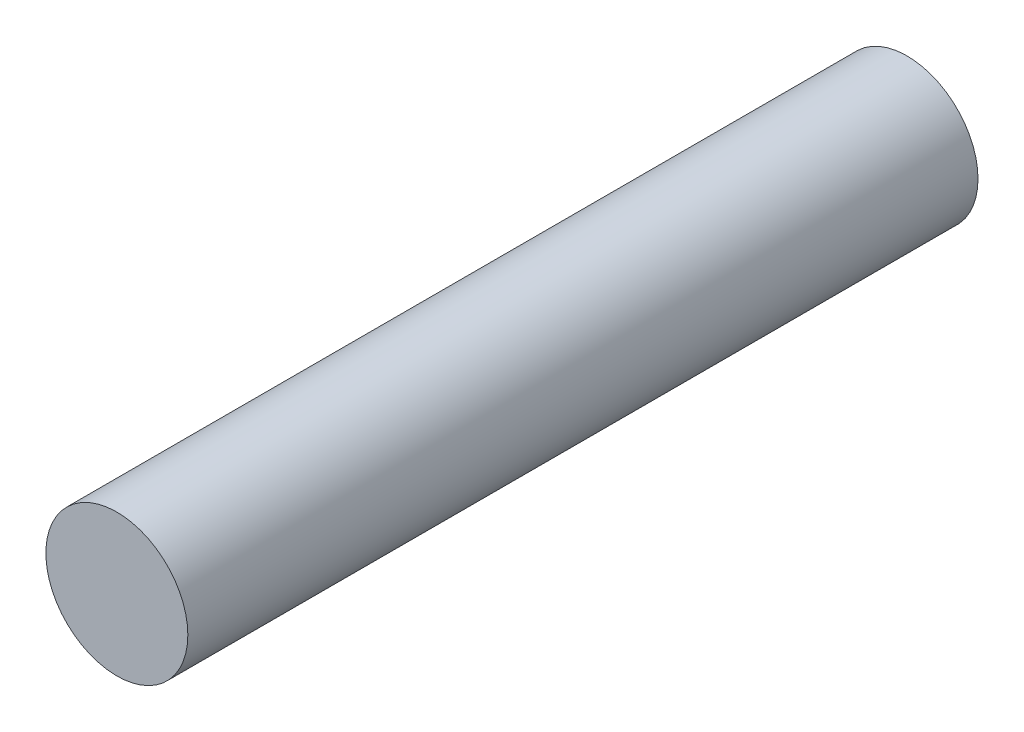
ISO-10303-21;
HEADER;
FILE_DESCRIPTION(('STEP AP214'),'2;1');
FILE_NAME('part.step','',(''),(''),'','','');
FILE_SCHEMA(('AUTOMOTIVE_DESIGN { 1 0 10303 214 1 1 1 1 }'));
ENDSEC;
DATA;
#1=APPLICATION_CONTEXT('core data for automotive mechanical design processes');
#2=APPLICATION_PROTOCOL_DEFINITION('international standard','automotive_design',2000,#1);
#3=PRODUCT_CONTEXT('',#1,'mechanical');
#4=PRODUCT('Part','Part','',(#3));
#5=PRODUCT_RELATED_PRODUCT_CATEGORY('part','',(#4));
#6=PRODUCT_DEFINITION_FORMATION('','',#4);
#7=PRODUCT_DEFINITION_CONTEXT('part definition',#1,'design');
#8=PRODUCT_DEFINITION('design','',#6,#7);
#9=PRODUCT_DEFINITION_SHAPE('','',#8);
#10=(LENGTH_UNIT() NAMED_UNIT(*) SI_UNIT(.MILLI.,.METRE.));
#11=(NAMED_UNIT(*) PLANE_ANGLE_UNIT() SI_UNIT($,.RADIAN.));
#12=(NAMED_UNIT(*) SI_UNIT($,.STERADIAN.) SOLID_ANGLE_UNIT());
#13=UNCERTAINTY_MEASURE_WITH_UNIT(LENGTH_MEASURE(1.E-05),#10,'distance_accuracy_value','');
#14=(GEOMETRIC_REPRESENTATION_CONTEXT(3) GLOBAL_UNCERTAINTY_ASSIGNED_CONTEXT((#13)) GLOBAL_UNIT_ASSIGNED_CONTEXT((#10,
#11,#12)) REPRESENTATION_CONTEXT('',''));
#15=CARTESIAN_POINT('',(0.,0.,0.));
#16=DIRECTION('',(0.,0.,1.));
#17=DIRECTION('',(1.,0.,0.));
#18=AXIS2_PLACEMENT_3D('',#15,#16,#17);
#19=CARTESIAN_POINT('',(0.,0.,101.6));
#20=DIRECTION('',(0.,0.,-1.));
#21=DIRECTION('',(-1.,0.,0.));
#22=AXIS2_PLACEMENT_3D('',#19,#20,#21);
#23=CYLINDRICAL_SURFACE('',#22,18.25625);
#24=CARTESIAN_POINT('',(0.,0.,101.6));
#25=DIRECTION('',(0.,0.,1.));
#26=DIRECTION('',(1.,0.,0.));
#27=AXIS2_PLACEMENT_3D('',#24,#25,#26);
#28=CIRCLE('',#27,18.25625);
#29=CARTESIAN_POINT('',(18.25625,0.,101.6));
#30=VERTEX_POINT('',#29);
#31=EDGE_CURVE('E10',#30,#30,#28,.T.);
#32=ORIENTED_EDGE('',*,*,#31,.F.);
#33=EDGE_LOOP('',(#32));
#34=FACE_BOUND('',#33,.T.);
#35=CARTESIAN_POINT('',(0.,0.,-101.6));
#36=DIRECTION('',(0.,0.,1.));
#37=DIRECTION('',(1.,0.,0.));
#38=AXIS2_PLACEMENT_3D('',#35,#36,#37);
#39=CIRCLE('',#38,18.25625);
#40=CARTESIAN_POINT('',(18.25625,0.,-101.6));
#41=VERTEX_POINT('',#40);
#42=EDGE_CURVE('E38',#41,#41,#39,.T.);
#43=ORIENTED_EDGE('',*,*,#42,.T.);
#44=EDGE_LOOP('',(#43));
#45=FACE_BOUND('',#44,.T.);
#46=ADVANCED_FACE('F35',(#34,#45),#23,.T.);
#47=CARTESIAN_POINT('',(0.,0.,101.6));
#48=DIRECTION('',(0.,0.,1.));
#49=DIRECTION('',(1.,0.,0.));
#50=AXIS2_PLACEMENT_3D('',#47,#48,#49);
#51=PLANE('',#50);
#52=ORIENTED_EDGE('',*,*,#31,.T.);
#53=EDGE_LOOP('',(#52));
#54=FACE_BOUND('',#53,.T.);
#55=ADVANCED_FACE('F50',(#54),#51,.T.);
#56=CARTESIAN_POINT('',(0.,0.,-101.6));
#57=DIRECTION('',(0.,0.,1.));
#58=DIRECTION('',(1.,0.,0.));
#59=AXIS2_PLACEMENT_3D('',#56,#57,#58);
#60=PLANE('',#59);
#61=ORIENTED_EDGE('',*,*,#42,.F.);
#62=EDGE_LOOP('',(#61));
#63=FACE_BOUND('',#62,.T.);
#64=ADVANCED_FACE('F48',(#63),#60,.F.);
#65=CLOSED_SHELL('',(#46,#55,#64));
#66=MANIFOLD_SOLID_BREP('B2',#65);
#67=ADVANCED_BREP_SHAPE_REPRESENTATION('',(#18,#66),#14);
#68=SHAPE_DEFINITION_REPRESENTATION(#9,#67);
ENDSEC;
END-ISO-10303-21;
